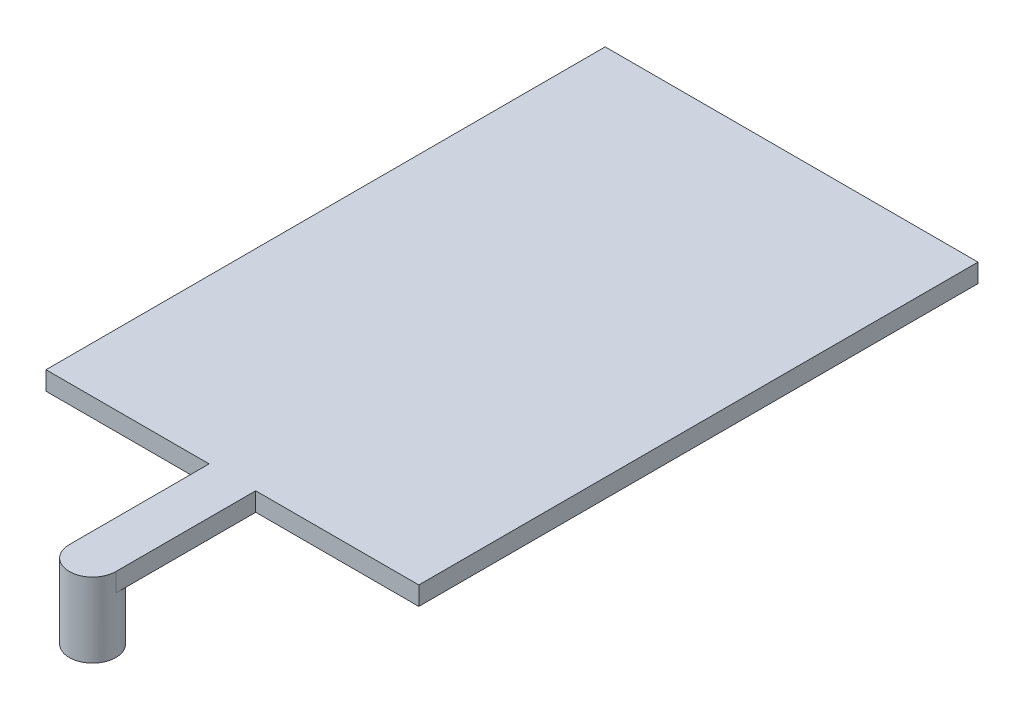
ISO-10303-21;
HEADER;
FILE_DESCRIPTION(('STEP AP214'),'2;1');
FILE_NAME('part.step','',(''),(''),'','','');
FILE_SCHEMA(('AUTOMOTIVE_DESIGN { 1 0 10303 214 1 1 1 1 }'));
ENDSEC;
DATA;
#1=APPLICATION_CONTEXT('core data for automotive mechanical design processes');
#2=APPLICATION_PROTOCOL_DEFINITION('international standard','automotive_design',2000,#1);
#3=PRODUCT_CONTEXT('',#1,'mechanical');
#4=PRODUCT('Part','Part','',(#3));
#5=PRODUCT_RELATED_PRODUCT_CATEGORY('part','',(#4));
#6=PRODUCT_DEFINITION_FORMATION('','',#4);
#7=PRODUCT_DEFINITION_CONTEXT('part definition',#1,'design');
#8=PRODUCT_DEFINITION('design','',#6,#7);
#9=PRODUCT_DEFINITION_SHAPE('','',#8);
#10=(LENGTH_UNIT() NAMED_UNIT(*) SI_UNIT(.MILLI.,.METRE.));
#11=(NAMED_UNIT(*) PLANE_ANGLE_UNIT() SI_UNIT($,.RADIAN.));
#12=(NAMED_UNIT(*) SI_UNIT($,.STERADIAN.) SOLID_ANGLE_UNIT());
#13=UNCERTAINTY_MEASURE_WITH_UNIT(LENGTH_MEASURE(1.E-05),#10,'distance_accuracy_value','');
#14=(GEOMETRIC_REPRESENTATION_CONTEXT(3) GLOBAL_UNCERTAINTY_ASSIGNED_CONTEXT((#13)) GLOBAL_UNIT_ASSIGNED_CONTEXT((#10,
#11,#12)) REPRESENTATION_CONTEXT('',''));
#15=CARTESIAN_POINT('',(0.,0.,0.));
#16=DIRECTION('',(0.,0.,1.));
#17=DIRECTION('',(1.,0.,0.));
#18=AXIS2_PLACEMENT_3D('',#15,#16,#17);
#19=CARTESIAN_POINT('',(0.,0.1,1.5));
#20=DIRECTION('',(0.,0.,-1.));
#21=DIRECTION('',(-1.,0.,0.));
#22=AXIS2_PLACEMENT_3D('',#19,#20,#21);
#23=PLANE('',#22);
#24=DIRECTION('',(1.,0.,0.));
#25=VECTOR('',#24,1.);
#26=CARTESIAN_POINT('',(0.,0.,1.5));
#27=LINE('',#26,#25);
#28=CARTESIAN_POINT('',(-1.,0.,1.5));
#29=VERTEX_POINT('',#28);
#30=CARTESIAN_POINT('',(-0.125,0.,1.5));
#31=VERTEX_POINT('',#30);
#32=EDGE_CURVE('E130',#29,#31,#27,.T.);
#33=ORIENTED_EDGE('',*,*,#32,.T.);
#34=DIRECTION('',(0.,-1.,0.));
#35=VECTOR('',#34,1.);
#36=CARTESIAN_POINT('',(-0.125,0.1,1.5));
#37=LINE('',#36,#35);
#38=CARTESIAN_POINT('',(-0.125,0.1,1.5));
#39=VERTEX_POINT('',#38);
#40=EDGE_CURVE('E44',#39,#31,#37,.T.);
#41=ORIENTED_EDGE('',*,*,#40,.F.);
#42=DIRECTION('',(1.,0.,0.));
#43=VECTOR('',#42,1.);
#44=CARTESIAN_POINT('',(0.,0.1,1.5));
#45=LINE('',#44,#43);
#46=CARTESIAN_POINT('',(-1.,0.1,1.5));
#47=VERTEX_POINT('',#46);
#48=EDGE_CURVE('E146',#47,#39,#45,.T.);
#49=ORIENTED_EDGE('',*,*,#48,.F.);
#50=DIRECTION('',(0.,-1.,0.));
#51=VECTOR('',#50,1.);
#52=CARTESIAN_POINT('',(-1.,0.1,1.5));
#53=LINE('',#52,#51);
#54=EDGE_CURVE('E52',#47,#29,#53,.T.);
#55=ORIENTED_EDGE('',*,*,#54,.T.);
#56=EDGE_LOOP('',(#33,#41,#49,#55));
#57=FACE_BOUND('',#56,.T.);
#58=ADVANCED_FACE('F35',(#57),#23,.F.);
#59=CARTESIAN_POINT('',(-0.125,0.1,0.));
#60=DIRECTION('',(1.,0.,0.));
#61=DIRECTION('',(0.,0.,-1.));
#62=AXIS2_PLACEMENT_3D('',#59,#60,#61);
#63=PLANE('',#62);
#64=DIRECTION('',(0.,0.,1.));
#65=VECTOR('',#64,1.);
#66=CARTESIAN_POINT('',(-0.125,0.,0.));
#67=LINE('',#66,#65);
#68=CARTESIAN_POINT('',(-0.125,0.,2.25));
#69=VERTEX_POINT('',#68);
#70=EDGE_CURVE('E132',#31,#69,#67,.T.);
#71=ORIENTED_EDGE('',*,*,#70,.T.);
#72=DIRECTION('',(0.,-1.,0.));
#73=VECTOR('',#72,1.);
#74=CARTESIAN_POINT('',(-0.125,0.1,2.25));
#75=LINE('',#74,#73);
#76=CARTESIAN_POINT('',(-0.125,0.1,2.25));
#77=VERTEX_POINT('',#76);
#78=EDGE_CURVE('E155',#77,#69,#75,.T.);
#79=ORIENTED_EDGE('',*,*,#78,.F.);
#80=DIRECTION('',(0.,0.,1.));
#81=VECTOR('',#80,1.);
#82=CARTESIAN_POINT('',(-0.125,0.1,0.));
#83=LINE('',#82,#81);
#84=EDGE_CURVE('E89',#39,#77,#83,.T.);
#85=ORIENTED_EDGE('',*,*,#84,.F.);
#86=ORIENTED_EDGE('',*,*,#40,.T.);
#87=EDGE_LOOP('',(#71,#79,#85,#86));
#88=FACE_BOUND('',#87,.T.);
#89=ADVANCED_FACE('F37',(#88),#63,.F.);
#90=CARTESIAN_POINT('',(0.124999999999998,0.1,0.));
#91=DIRECTION('',(1.,0.,0.));
#92=DIRECTION('',(0.,0.,-1.));
#93=AXIS2_PLACEMENT_3D('',#90,#91,#92);
#94=PLANE('',#93);
#95=DIRECTION('',(0.,0.,1.));
#96=VECTOR('',#95,1.);
#97=CARTESIAN_POINT('',(0.124999999999998,0.,0.));
#98=LINE('',#97,#96);
#99=CARTESIAN_POINT('',(0.124999999999999,0.,1.5));
#100=VERTEX_POINT('',#99);
#101=CARTESIAN_POINT('',(0.125,0.,2.25));
#102=VERTEX_POINT('',#101);
#103=EDGE_CURVE('E137',#100,#102,#98,.T.);
#104=ORIENTED_EDGE('',*,*,#103,.F.);
#105=DIRECTION('',(0.,-1.,0.));
#106=VECTOR('',#105,1.);
#107=CARTESIAN_POINT('',(0.124999999999999,0.1,1.5));
#108=LINE('',#107,#106);
#109=CARTESIAN_POINT('',(0.124999999999999,0.1,1.5));
#110=VERTEX_POINT('',#109);
#111=EDGE_CURVE('E150',#110,#100,#108,.T.);
#112=ORIENTED_EDGE('',*,*,#111,.F.);
#113=DIRECTION('',(0.,0.,1.));
#114=VECTOR('',#113,1.);
#115=CARTESIAN_POINT('',(0.124999999999998,0.1,0.));
#116=LINE('',#115,#114);
#117=CARTESIAN_POINT('',(0.125,0.1,2.25));
#118=VERTEX_POINT('',#117);
#119=EDGE_CURVE('E189',#110,#118,#116,.T.);
#120=ORIENTED_EDGE('',*,*,#119,.T.);
#121=DIRECTION('',(0.,-1.,0.));
#122=VECTOR('',#121,1.);
#123=CARTESIAN_POINT('',(0.125,0.1,2.25));
#124=LINE('',#123,#122);
#125=EDGE_CURVE('E152',#118,#102,#124,.T.);
#126=ORIENTED_EDGE('',*,*,#125,.T.);
#127=EDGE_LOOP('',(#104,#112,#120,#126));
#128=FACE_BOUND('',#127,.T.);
#129=ADVANCED_FACE('F175',(#128),#94,.T.);
#130=CARTESIAN_POINT('',(1.,0.,1.5));
#131=VERTEX_POINT('',#130);
#132=EDGE_CURVE('E134',#100,#131,#27,.T.);
#133=ORIENTED_EDGE('',*,*,#132,.T.);
#134=DIRECTION('',(0.,-1.,0.));
#135=VECTOR('',#134,1.);
#136=CARTESIAN_POINT('',(1.,0.1,1.5));
#137=LINE('',#136,#135);
#138=CARTESIAN_POINT('',(1.,0.1,1.5));
#139=VERTEX_POINT('',#138);
#140=EDGE_CURVE('E122',#139,#131,#137,.T.);
#141=ORIENTED_EDGE('',*,*,#140,.F.);
#142=EDGE_CURVE('E110',#110,#139,#45,.T.);
#143=ORIENTED_EDGE('',*,*,#142,.F.);
#144=ORIENTED_EDGE('',*,*,#111,.T.);
#145=EDGE_LOOP('',(#133,#141,#143,#144));
#146=FACE_BOUND('',#145,.T.);
#147=ADVANCED_FACE('F171',(#146),#23,.F.);
#148=CARTESIAN_POINT('',(1.,0.1,0.));
#149=DIRECTION('',(-1.,0.,0.));
#150=DIRECTION('',(0.,0.,1.));
#151=AXIS2_PLACEMENT_3D('',#148,#149,#150);
#152=PLANE('',#151);
#153=DIRECTION('',(0.,0.,-1.));
#154=VECTOR('',#153,1.);
#155=CARTESIAN_POINT('',(1.,0.,0.));
#156=LINE('',#155,#154);
#157=CARTESIAN_POINT('',(1.,0.,-1.5));
#158=VERTEX_POINT('',#157);
#159=EDGE_CURVE('E119',#131,#158,#156,.T.);
#160=ORIENTED_EDGE('',*,*,#159,.T.);
#161=DIRECTION('',(0.,-1.,0.));
#162=VECTOR('',#161,1.);
#163=CARTESIAN_POINT('',(1.,0.1,-1.5));
#164=LINE('',#163,#162);
#165=CARTESIAN_POINT('',(1.,0.1,-1.5));
#166=VERTEX_POINT('',#165);
#167=EDGE_CURVE('E116',#166,#158,#164,.T.);
#168=ORIENTED_EDGE('',*,*,#167,.F.);
#169=DIRECTION('',(0.,0.,-1.));
#170=VECTOR('',#169,1.);
#171=CARTESIAN_POINT('',(1.,0.1,0.));
#172=LINE('',#171,#170);
#173=EDGE_CURVE('E102',#139,#166,#172,.T.);
#174=ORIENTED_EDGE('',*,*,#173,.F.);
#175=ORIENTED_EDGE('',*,*,#140,.T.);
#176=EDGE_LOOP('',(#160,#168,#174,#175));
#177=FACE_BOUND('',#176,.T.);
#178=ADVANCED_FACE('F117',(#177),#152,.F.);
#179=CARTESIAN_POINT('',(0.,0.1,-1.5));
#180=DIRECTION('',(0.,0.,-1.));
#181=DIRECTION('',(-1.,0.,0.));
#182=AXIS2_PLACEMENT_3D('',#179,#180,#181);
#183=PLANE('',#182);
#184=DIRECTION('',(1.,0.,0.));
#185=VECTOR('',#184,1.);
#186=CARTESIAN_POINT('',(0.,0.,-1.5));
#187=LINE('',#186,#185);
#188=CARTESIAN_POINT('',(-1.,0.,-1.5));
#189=VERTEX_POINT('',#188);
#190=EDGE_CURVE('E141',#189,#158,#187,.T.);
#191=ORIENTED_EDGE('',*,*,#190,.F.);
#192=DIRECTION('',(0.,-1.,0.));
#193=VECTOR('',#192,1.);
#194=CARTESIAN_POINT('',(-1.,0.1,-1.5));
#195=LINE('',#194,#193);
#196=CARTESIAN_POINT('',(-1.,0.1,-1.5));
#197=VERTEX_POINT('',#196);
#198=EDGE_CURVE('E76',#197,#189,#195,.T.);
#199=ORIENTED_EDGE('',*,*,#198,.F.);
#200=DIRECTION('',(1.,0.,0.));
#201=VECTOR('',#200,1.);
#202=CARTESIAN_POINT('',(0.,0.1,-1.5));
#203=LINE('',#202,#201);
#204=EDGE_CURVE('E107',#197,#166,#203,.T.);
#205=ORIENTED_EDGE('',*,*,#204,.T.);
#206=ORIENTED_EDGE('',*,*,#167,.T.);
#207=EDGE_LOOP('',(#191,#199,#205,#206));
#208=FACE_BOUND('',#207,.T.);
#209=ADVANCED_FACE('F124',(#208),#183,.T.);
#210=CARTESIAN_POINT('',(-1.,0.1,0.));
#211=DIRECTION('',(-1.,0.,0.));
#212=DIRECTION('',(0.,0.,1.));
#213=AXIS2_PLACEMENT_3D('',#210,#211,#212);
#214=PLANE('',#213);
#215=DIRECTION('',(0.,0.,-1.));
#216=VECTOR('',#215,1.);
#217=CARTESIAN_POINT('',(-1.,0.,0.));
#218=LINE('',#217,#216);
#219=EDGE_CURVE('E143',#29,#189,#218,.T.);
#220=ORIENTED_EDGE('',*,*,#219,.F.);
#221=ORIENTED_EDGE('',*,*,#54,.F.);
#222=DIRECTION('',(0.,0.,-1.));
#223=VECTOR('',#222,1.);
#224=CARTESIAN_POINT('',(-1.,0.1,0.));
#225=LINE('',#224,#223);
#226=EDGE_CURVE('E125',#47,#197,#225,.T.);
#227=ORIENTED_EDGE('',*,*,#226,.T.);
#228=ORIENTED_EDGE('',*,*,#198,.T.);
#229=EDGE_LOOP('',(#220,#221,#227,#228));
#230=FACE_BOUND('',#229,.T.);
#231=ADVANCED_FACE('F159',(#230),#214,.T.);
#232=CARTESIAN_POINT('',(0.,0.1,0.));
#233=DIRECTION('',(0.,1.,0.));
#234=DIRECTION('',(0.,0.,1.));
#235=AXIS2_PLACEMENT_3D('',#232,#233,#234);
#236=PLANE('',#235);
#237=ORIENTED_EDGE('',*,*,#84,.T.);
#238=CARTESIAN_POINT('',(0.,0.1,2.25));
#239=DIRECTION('',(0.,1.,0.));
#240=DIRECTION('',(0.,0.,1.));
#241=AXIS2_PLACEMENT_3D('',#238,#239,#240);
#242=CIRCLE('',#241,0.125);
#243=EDGE_CURVE('E196',#77,#118,#242,.T.);
#244=ORIENTED_EDGE('',*,*,#243,.T.);
#245=ORIENTED_EDGE('',*,*,#119,.F.);
#246=ORIENTED_EDGE('',*,*,#142,.T.);
#247=ORIENTED_EDGE('',*,*,#173,.T.);
#248=ORIENTED_EDGE('',*,*,#204,.F.);
#249=ORIENTED_EDGE('',*,*,#226,.F.);
#250=ORIENTED_EDGE('',*,*,#48,.T.);
#251=EDGE_LOOP('',(#237,#244,#245,#246,#247,#248,#249,#250));
#252=FACE_BOUND('',#251,.T.);
#253=ADVANCED_FACE('F104',(#252),#236,.T.);
#254=CARTESIAN_POINT('',(0.,0.,0.));
#255=DIRECTION('',(0.,1.,0.));
#256=DIRECTION('',(0.,0.,1.));
#257=AXIS2_PLACEMENT_3D('',#254,#255,#256);
#258=PLANE('',#257);
#259=ORIENTED_EDGE('',*,*,#103,.T.);
#260=CARTESIAN_POINT('',(0.,0.,2.25));
#261=DIRECTION('',(0.,1.,0.));
#262=DIRECTION('',(0.,0.,1.));
#263=AXIS2_PLACEMENT_3D('',#260,#261,#262);
#264=CIRCLE('',#263,0.125);
#265=EDGE_CURVE('E11',#102,#69,#264,.T.);
#266=ORIENTED_EDGE('',*,*,#265,.T.);
#267=ORIENTED_EDGE('',*,*,#70,.F.);
#268=ORIENTED_EDGE('',*,*,#32,.F.);
#269=ORIENTED_EDGE('',*,*,#219,.T.);
#270=ORIENTED_EDGE('',*,*,#190,.T.);
#271=ORIENTED_EDGE('',*,*,#159,.F.);
#272=ORIENTED_EDGE('',*,*,#132,.F.);
#273=EDGE_LOOP('',(#259,#266,#267,#268,#269,#270,#271,#272));
#274=FACE_BOUND('',#273,.T.);
#275=ADVANCED_FACE('F158',(#274),#258,.F.);
#276=CARTESIAN_POINT('',(0.,-0.3,2.25));
#277=DIRECTION('',(0.,1.,0.));
#278=DIRECTION('',(0.,0.,1.));
#279=AXIS2_PLACEMENT_3D('',#276,#277,#278);
#280=CYLINDRICAL_SURFACE('',#279,0.125);
#281=CARTESIAN_POINT('',(0.,-0.3,2.25));
#282=DIRECTION('',(0.,1.,0.));
#283=DIRECTION('',(0.,0.,1.));
#284=AXIS2_PLACEMENT_3D('',#281,#282,#283);
#285=CIRCLE('',#284,0.125);
#286=CARTESIAN_POINT('',(0.,-0.3,2.375));
#287=VERTEX_POINT('',#286);
#288=EDGE_CURVE('E133',#287,#287,#285,.T.);
#289=ORIENTED_EDGE('',*,*,#288,.T.);
#290=EDGE_LOOP('',(#289));
#291=FACE_BOUND('',#290,.T.);
#292=ORIENTED_EDGE('',*,*,#78,.T.);
#293=ORIENTED_EDGE('',*,*,#265,.F.);
#294=ORIENTED_EDGE('',*,*,#125,.F.);
#295=ORIENTED_EDGE('',*,*,#243,.F.);
#296=EDGE_LOOP('',(#292,#293,#294,#295));
#297=FACE_BOUND('',#296,.T.);
#298=ADVANCED_FACE('F195',(#291,#297),#280,.T.);
#299=CARTESIAN_POINT('',(0.,-0.3,2.25));
#300=DIRECTION('',(0.,1.,0.));
#301=DIRECTION('',(0.,0.,1.));
#302=AXIS2_PLACEMENT_3D('',#299,#300,#301);
#303=PLANE('',#302);
#304=ORIENTED_EDGE('',*,*,#288,.F.);
#305=EDGE_LOOP('',(#304));
#306=FACE_BOUND('',#305,.T.);
#307=ADVANCED_FACE('F206',(#306),#303,.F.);
#308=CLOSED_SHELL('',(#58,#89,#129,#147,#178,#209,#231,#253,#275,#298,#307));
#309=MANIFOLD_SOLID_BREP('B2',#308);
#310=ADVANCED_BREP_SHAPE_REPRESENTATION('',(#18,#309),#14);
#311=SHAPE_DEFINITION_REPRESENTATION(#9,#310);
ENDSEC;
END-ISO-10303-21;
